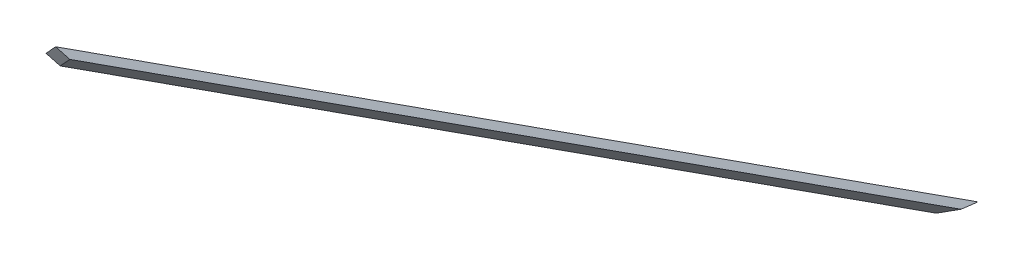
ISO-10303-21;
HEADER;
FILE_DESCRIPTION(('STEP AP214'),'2;1');
FILE_NAME('part.step','',(''),(''),'','','');
FILE_SCHEMA(('AUTOMOTIVE_DESIGN { 1 0 10303 214 1 1 1 1 }'));
ENDSEC;
DATA;
#1=APPLICATION_CONTEXT('core data for automotive mechanical design processes');
#2=APPLICATION_PROTOCOL_DEFINITION('international standard','automotive_design',2000,#1);
#3=PRODUCT_CONTEXT('',#1,'mechanical');
#4=PRODUCT('Part','Part','',(#3));
#5=PRODUCT_RELATED_PRODUCT_CATEGORY('part','',(#4));
#6=PRODUCT_DEFINITION_FORMATION('','',#4);
#7=PRODUCT_DEFINITION_CONTEXT('part definition',#1,'design');
#8=PRODUCT_DEFINITION('design','',#6,#7);
#9=PRODUCT_DEFINITION_SHAPE('','',#8);
#10=(LENGTH_UNIT() NAMED_UNIT(*) SI_UNIT(.MILLI.,.METRE.));
#11=(NAMED_UNIT(*) PLANE_ANGLE_UNIT() SI_UNIT($,.RADIAN.));
#12=(NAMED_UNIT(*) SI_UNIT($,.STERADIAN.) SOLID_ANGLE_UNIT());
#13=UNCERTAINTY_MEASURE_WITH_UNIT(LENGTH_MEASURE(1.E-05),#10,'distance_accuracy_value','');
#14=(GEOMETRIC_REPRESENTATION_CONTEXT(3) GLOBAL_UNCERTAINTY_ASSIGNED_CONTEXT((#13)) GLOBAL_UNIT_ASSIGNED_CONTEXT((#10,
#11,#12)) REPRESENTATION_CONTEXT('',''));
#15=CARTESIAN_POINT('',(0.,0.,0.));
#16=DIRECTION('',(0.,0.,1.));
#17=DIRECTION('',(1.,0.,0.));
#18=AXIS2_PLACEMENT_3D('',#15,#16,#17);
#19=CARTESIAN_POINT('',(11.0209605962285,-17.268911455813,13.9795177746732));
#20=DIRECTION('',(0.444370527755255,-0.696290965780646,0.563661001875038));
#21=DIRECTION('',(0.,-0.629196129232445,-0.777246570245832));
#22=AXIS2_PLACEMENT_3D('',#19,#20,#21);
#23=PLANE('',#22);
#24=DIRECTION('',(-0.654469130781622,-0.681969712719897,-0.326477361828794));
#25=VECTOR('',#24,1.);
#26=CARTESIAN_POINT('',(4121.49633100113,4230.46380740736,2020.65339402457));
#27=LINE('',#26,#25);
#28=CARTESIAN_POINT('',(4121.49633100113,4230.46380740736,2020.65339402457));
#29=VERTEX_POINT('',#28);
#30=CARTESIAN_POINT('',(4054.1396550993,4160.27682569338,1987.05298597519));
#31=VERTEX_POINT('',#30);
#32=EDGE_CURVE('E75',#29,#31,#27,.T.);
#33=ORIENTED_EDGE('',*,*,#32,.T.);
#34=DIRECTION('',(-0.467086179481502,0.356822089773414,0.809016994374721));
#35=VECTOR('',#34,1.);
#36=CARTESIAN_POINT('',(5173.6571374515,3305.04157117521,47.9918265807309));
#37=LINE('',#36,#35);
#38=CARTESIAN_POINT('',(5173.65713745139,3305.04157117537,47.9918265805983));
#39=VERTEX_POINT('',#38);
#40=EDGE_CURVE('E57',#39,#31,#37,.T.);
#41=ORIENTED_EDGE('',*,*,#40,.F.);
#42=DIRECTION('',(-0.842960923517797,-0.537974796270256,0.));
#43=VECTOR('',#42,1.);
#44=CARTESIAN_POINT('',(-1.4653091794716,2.29601532958428,47.9918265807308));
#45=LINE('',#44,#43);
#46=CARTESIAN_POINT('',(5260.41301798542,3360.40887925979,47.9918265805981));
#47=VERTEX_POINT('',#46);
#48=EDGE_CURVE('E19',#39,#47,#45,.F.);
#49=ORIENTED_EDGE('',*,*,#48,.T.);
#50=DIRECTION('',(-0.467086179481499,0.356822089773409,0.809016994374725));
#51=VECTOR('',#50,1.);
#52=CARTESIAN_POINT('',(5260.41301798552,3360.40887925963,47.9918265807302));
#53=LINE('',#52,#51);
#54=EDGE_CURVE('E54',#47,#29,#53,.T.);
#55=ORIENTED_EDGE('',*,*,#54,.T.);
#56=EDGE_LOOP('',(#33,#41,#49,#55));
#57=FACE_BOUND('',#56,.T.);
#58=ADVANCED_FACE('F16',(#57),#23,.T.);
#59=CARTESIAN_POINT('',(0.,0.,0.));
#60=DIRECTION('',(-0.537110456627946,0.841606576533205,-0.0566632836762697));
#61=DIRECTION('',(-0.842960923517797,-0.537974796270256,0.));
#62=AXIS2_PLACEMENT_3D('',#59,#60,#61);
#63=PLANE('',#62);
#64=DIRECTION('',(-0.228891628225112,-0.0807637152778473,0.970095791570593));
#65=VECTOR('',#64,1.);
#66=CARTESIAN_POINT('',(5184.9806865515,3309.03705105597,-6.66133814775094E-13));
#67=LINE('',#66,#65);
#68=CARTESIAN_POINT('',(5184.9806865515,3309.03705105597,-1.69858135553973E-12));
#69=VERTEX_POINT('',#68);
#70=EDGE_CURVE('E78',#69,#39,#67,.T.);
#71=ORIENTED_EDGE('',*,*,#70,.F.);
#72=DIRECTION('',(0.842960923517807,0.537974796270239,0.));
#73=VECTOR('',#72,1.);
#74=CARTESIAN_POINT('',(5184.9806865515,3309.03705105597,-1.33226762955019E-12));
#75=LINE('',#74,#73);
#76=CARTESIAN_POINT('',(5271.73656708553,3364.4043591404,-3.11382965840998E-12));
#77=VERTEX_POINT('',#76);
#78=EDGE_CURVE('E72',#69,#77,#75,.T.);
#79=ORIENTED_EDGE('',*,*,#78,.T.);
#80=DIRECTION('',(-0.228891628225154,-0.0807637152777714,0.97009579157059));
#81=VECTOR('',#80,1.);
#82=CARTESIAN_POINT('',(5271.73656708553,3364.40435914038,-3.5527136788005E-12));
#83=LINE('',#82,#81);
#84=EDGE_CURVE('E62',#77,#47,#83,.T.);
#85=ORIENTED_EDGE('',*,*,#84,.T.);
#86=ORIENTED_EDGE('',*,*,#48,.F.);
#87=EDGE_LOOP('',(#71,#79,#85,#86));
#88=FACE_BOUND('',#87,.T.);
#89=ADVANCED_FACE('F71',(#88),#63,.F.);
#90=CARTESIAN_POINT('',(4947.97601181323,3221.86097653058,1435.69301138923));
#91=DIRECTION('',(-0.814278199040255,-0.530215010595009,-0.23626903543946));
#92=DIRECTION('',(0.545664026406652,-0.838004039540192,0.));
#93=AXIS2_PLACEMENT_3D('',#90,#91,#92);
#94=PLANE('',#93);
#95=DIRECTION('',(0.577222347304792,-0.696579994970608,-0.426134570738744));
#96=VECTOR('',#95,1.);
#97=CARTESIAN_POINT('',(4092.94043473807,4264.92447264007,2041.73479299143));
#98=LINE('',#97,#96);
#99=CARTESIAN_POINT('',(4092.94043473806,4264.92447264006,2041.73479299144));
#100=VERTEX_POINT('',#99);
#101=EDGE_CURVE('E68',#100,#29,#98,.T.);
#102=ORIENTED_EDGE('',*,*,#101,.T.);
#103=ORIENTED_EDGE('',*,*,#54,.F.);
#104=ORIENTED_EDGE('',*,*,#84,.F.);
#105=DIRECTION('',(-0.467086179481364,0.356822089773112,0.809016994374934));
#106=VECTOR('',#105,1.);
#107=CARTESIAN_POINT('',(5271.73656708554,3364.40435914039,-3.5527136788005E-12));
#108=LINE('',#107,#106);
#109=EDGE_CURVE('E82',#77,#100,#108,.T.);
#110=ORIENTED_EDGE('',*,*,#109,.T.);
#111=EDGE_LOOP('',(#102,#103,#104,#110));
#112=FACE_BOUND('',#111,.T.);
#113=ADVANCED_FACE('F65',(#112),#94,.F.);
#114=CARTESIAN_POINT('',(0.,0.,0.));
#115=DIRECTION('',(-0.0650366103204272,0.480974248354035,-0.87431917040535));
#116=DIRECTION('',(0.,0.876174137459205,0.481994689646699));
#117=AXIS2_PLACEMENT_3D('',#114,#115,#116);
#118=PLANE('',#117);
#119=DIRECTION('',(-0.577222347305049,0.696579994970303,0.426134570738895));
#120=VECTOR('',#119,1.);
#121=CARTESIAN_POINT('',(4054.1396550993,4160.27682569338,1987.05298597519));
#122=LINE('',#121,#120);
#123=CARTESIAN_POINT('',(4025.58375883623,4194.73749092607,2008.13438494205));
#124=VERTEX_POINT('',#123);
#125=EDGE_CURVE('E33',#31,#124,#122,.T.);
#126=ORIENTED_EDGE('',*,*,#125,.F.);
#127=ORIENTED_EDGE('',*,*,#32,.F.);
#128=ORIENTED_EDGE('',*,*,#101,.F.);
#129=DIRECTION('',(-0.654469130781583,-0.681969712719914,-0.326477361828837));
#130=VECTOR('',#129,1.);
#131=CARTESIAN_POINT('',(4092.94043473807,4264.92447264007,2041.73479299145));
#132=LINE('',#131,#130);
#133=EDGE_CURVE('E25',#100,#124,#132,.T.);
#134=ORIENTED_EDGE('',*,*,#133,.T.);
#135=EDGE_LOOP('',(#126,#127,#128,#134));
#136=FACE_BOUND('',#135,.T.);
#137=ADVANCED_FACE('F87',(#136),#118,.F.);
#138=CARTESIAN_POINT('',(4866.54819190921,3168.83947547108,1412.06610784528));
#139=DIRECTION('',(-0.814278199040255,-0.530215010595009,-0.236269035439461));
#140=DIRECTION('',(0.545664026406652,-0.838004039540192,0.));
#141=AXIS2_PLACEMENT_3D('',#138,#139,#140);
#142=PLANE('',#141);
#143=ORIENTED_EDGE('',*,*,#70,.T.);
#144=ORIENTED_EDGE('',*,*,#40,.T.);
#145=ORIENTED_EDGE('',*,*,#125,.T.);
#146=DIRECTION('',(0.467086179481365,-0.35682208977311,-0.809016994374934));
#147=VECTOR('',#146,1.);
#148=CARTESIAN_POINT('',(4025.58375883623,4194.73749092606,2008.13438494205));
#149=LINE('',#148,#147);
#150=EDGE_CURVE('E11',#124,#69,#149,.T.);
#151=ORIENTED_EDGE('',*,*,#150,.T.);
#152=EDGE_LOOP('',(#143,#144,#145,#151));
#153=FACE_BOUND('',#152,.T.);
#154=ADVANCED_FACE('F90',(#153),#142,.T.);
#155=CARTESIAN_POINT('',(0.,0.,0.));
#156=DIRECTION('',(0.444370527755255,-0.696290965780646,0.563661001875038));
#157=DIRECTION('',(0.,-0.629196129232445,-0.777246570245832));
#158=AXIS2_PLACEMENT_3D('',#155,#156,#157);
#159=PLANE('',#158);
#160=ORIENTED_EDGE('',*,*,#133,.F.);
#161=ORIENTED_EDGE('',*,*,#109,.F.);
#162=ORIENTED_EDGE('',*,*,#78,.F.);
#163=ORIENTED_EDGE('',*,*,#150,.F.);
#164=EDGE_LOOP('',(#160,#161,#162,#163));
#165=FACE_BOUND('',#164,.T.);
#166=ADVANCED_FACE('F89',(#165),#159,.F.);
#167=CLOSED_SHELL('',(#58,#89,#113,#137,#154,#166));
#168=MANIFOLD_SOLID_BREP('B1',#167);
#169=ADVANCED_BREP_SHAPE_REPRESENTATION('',(#18,#168),#14);
#170=SHAPE_DEFINITION_REPRESENTATION(#9,#169);
ENDSEC;
END-ISO-10303-21;
